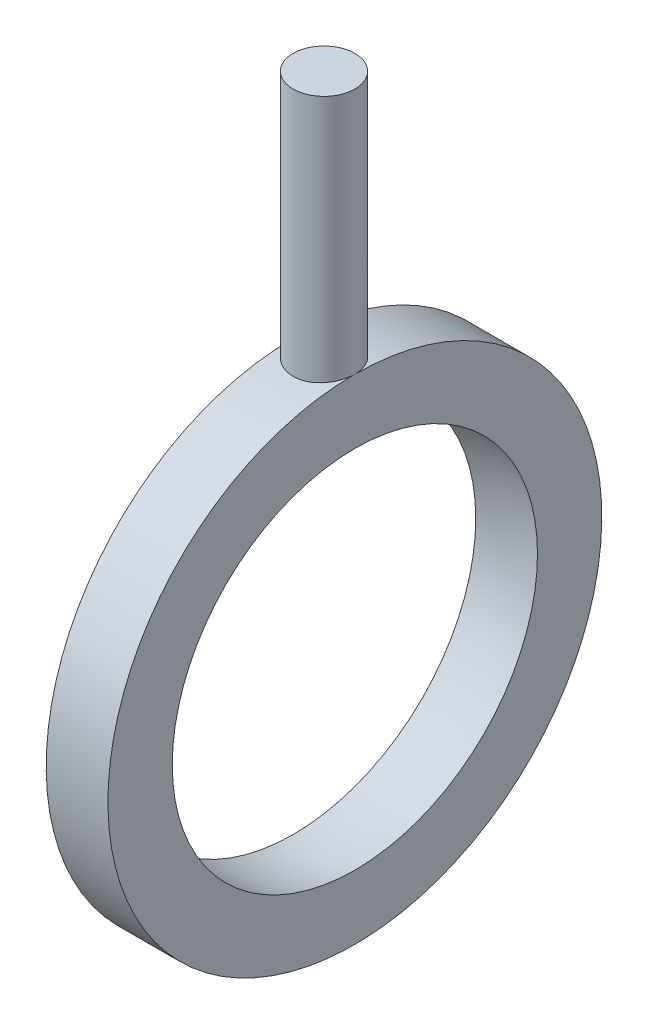
ISO-10303-21;
HEADER;
FILE_DESCRIPTION(('STEP AP214'),'2;1');
FILE_NAME('part.step','',(''),(''),'','','');
FILE_SCHEMA(('AUTOMOTIVE_DESIGN { 1 0 10303 214 1 1 1 1 }'));
ENDSEC;
DATA;
#1=APPLICATION_CONTEXT('core data for automotive mechanical design processes');
#2=APPLICATION_PROTOCOL_DEFINITION('international standard','automotive_design',2000,#1);
#3=PRODUCT_CONTEXT('',#1,'mechanical');
#4=PRODUCT('Part','Part','',(#3));
#5=PRODUCT_RELATED_PRODUCT_CATEGORY('part','',(#4));
#6=PRODUCT_DEFINITION_FORMATION('','',#4);
#7=PRODUCT_DEFINITION_CONTEXT('part definition',#1,'design');
#8=PRODUCT_DEFINITION('design','',#6,#7);
#9=PRODUCT_DEFINITION_SHAPE('','',#8);
#10=(LENGTH_UNIT() NAMED_UNIT(*) SI_UNIT(.MILLI.,.METRE.));
#11=(NAMED_UNIT(*) PLANE_ANGLE_UNIT() SI_UNIT($,.RADIAN.));
#12=(NAMED_UNIT(*) SI_UNIT($,.STERADIAN.) SOLID_ANGLE_UNIT());
#13=UNCERTAINTY_MEASURE_WITH_UNIT(LENGTH_MEASURE(1.E-05),#10,'distance_accuracy_value','');
#14=(GEOMETRIC_REPRESENTATION_CONTEXT(3) GLOBAL_UNCERTAINTY_ASSIGNED_CONTEXT((#13)) GLOBAL_UNIT_ASSIGNED_CONTEXT((#10,
#11,#12)) REPRESENTATION_CONTEXT('',''));
#15=CARTESIAN_POINT('',(0.,0.,0.));
#16=DIRECTION('',(0.,0.,1.));
#17=DIRECTION('',(1.,0.,0.));
#18=AXIS2_PLACEMENT_3D('',#15,#16,#17);
#19=CARTESIAN_POINT('',(2.5,20.,0.));
#20=DIRECTION('',(-1.,0.,0.));
#21=DIRECTION('',(0.,0.,1.));
#22=AXIS2_PLACEMENT_3D('',#19,#20,#21);
#23=PLANE('',#22);
#24=CARTESIAN_POINT('',(2.5,0.,0.));
#25=DIRECTION('',(-1.,0.,0.));
#26=DIRECTION('',(0.,0.,1.));
#27=AXIS2_PLACEMENT_3D('',#24,#25,#26);
#28=CIRCLE('',#27,20.);
#29=CARTESIAN_POINT('',(2.5,20.,0.));
#30=VERTEX_POINT('',#29);
#31=EDGE_CURVE('E57',#30,#30,#28,.T.);
#32=ORIENTED_EDGE('',*,*,#31,.F.);
#33=EDGE_LOOP('',(#32));
#34=FACE_BOUND('',#33,.T.);
#35=CARTESIAN_POINT('',(2.5,0.,0.));
#36=DIRECTION('',(-1.,0.,0.));
#37=DIRECTION('',(0.,0.,1.));
#38=AXIS2_PLACEMENT_3D('',#35,#36,#37);
#39=CIRCLE('',#38,14.790199457749);
#40=CARTESIAN_POINT('',(2.5,0.,14.790199457749));
#41=VERTEX_POINT('',#40);
#42=EDGE_CURVE('E46',#41,#41,#39,.T.);
#43=ORIENTED_EDGE('',*,*,#42,.T.);
#44=EDGE_LOOP('',(#43));
#45=FACE_BOUND('',#44,.T.);
#46=ADVANCED_FACE('F34',(#34,#45),#23,.F.);
#47=CARTESIAN_POINT('',(0.,0.,0.));
#48=DIRECTION('',(-1.,0.,0.));
#49=DIRECTION('',(0.,1.,0.));
#50=AXIS2_PLACEMENT_3D('',#47,#48,#49);
#51=SPHERICAL_SURFACE('',#50,15.);
#52=ORIENTED_EDGE('',*,*,#42,.F.);
#53=EDGE_LOOP('',(#52));
#54=FACE_BOUND('',#53,.T.);
#55=CARTESIAN_POINT('',(-2.5,0.,0.));
#56=DIRECTION('',(-1.,0.,0.));
#57=DIRECTION('',(0.,0.,1.));
#58=AXIS2_PLACEMENT_3D('',#55,#56,#57);
#59=CIRCLE('',#58,14.790199457749);
#60=CARTESIAN_POINT('',(-2.5,0.,14.790199457749));
#61=VERTEX_POINT('',#60);
#62=EDGE_CURVE('E66',#61,#61,#59,.T.);
#63=ORIENTED_EDGE('',*,*,#62,.T.);
#64=EDGE_LOOP('',(#63));
#65=FACE_BOUND('',#64,.T.);
#66=ADVANCED_FACE('F75',(#54,#65),#51,.F.);
#67=CARTESIAN_POINT('',(-2.5,20.,0.));
#68=DIRECTION('',(1.,0.,0.));
#69=DIRECTION('',(0.,0.,-1.));
#70=AXIS2_PLACEMENT_3D('',#67,#68,#69);
#71=PLANE('',#70);
#72=ORIENTED_EDGE('',*,*,#62,.F.);
#73=EDGE_LOOP('',(#72));
#74=FACE_BOUND('',#73,.T.);
#75=CARTESIAN_POINT('',(-2.5,0.,0.));
#76=DIRECTION('',(-1.,0.,0.));
#77=DIRECTION('',(0.,0.,1.));
#78=AXIS2_PLACEMENT_3D('',#75,#76,#77);
#79=CIRCLE('',#78,20.);
#80=CARTESIAN_POINT('',(-2.5,20.,0.));
#81=VERTEX_POINT('',#80);
#82=EDGE_CURVE('E62',#81,#81,#79,.T.);
#83=ORIENTED_EDGE('',*,*,#82,.T.);
#84=EDGE_LOOP('',(#83));
#85=FACE_BOUND('',#84,.T.);
#86=ADVANCED_FACE('F65',(#74,#85),#71,.F.);
#87=CARTESIAN_POINT('',(0.,0.,0.));
#88=DIRECTION('',(-1.,0.,0.));
#89=DIRECTION('',(0.,0.,1.));
#90=AXIS2_PLACEMENT_3D('',#87,#88,#89);
#91=CYLINDRICAL_SURFACE('',#90,20.);
#92=ORIENTED_EDGE('',*,*,#31,.T.);
#93=CARTESIAN_POINT('',(2.5,20.,0.));
#94=CARTESIAN_POINT('',(2.49999405906428,19.9999980489643,0.139841095555762));
#95=CARTESIAN_POINT('',(2.48822712083072,19.998517845549,0.279769574302748));
#96=CARTESIAN_POINT('',(2.44147224542921,19.9927554011136,0.555732802089754));
#97=CARTESIAN_POINT('',(2.40646006207661,19.9884702344143,0.691763330623746));
#98=CARTESIAN_POINT('',(2.31426235608592,19.9775806104441,0.955895574813055));
#99=CARTESIAN_POINT('',(2.25709175819015,19.9709777145554,1.08400256014614));
#100=CARTESIAN_POINT('',(2.12223271603021,19.956187008781,1.32877947489304));
#101=CARTESIAN_POINT('',(2.04454779146929,19.9479994708412,1.44545136155637));
#102=CARTESIAN_POINT('',(1.87040805016041,19.9309032130633,1.66471281693132));
#103=CARTESIAN_POINT('',(1.77386287065376,19.9219911469242,1.76723036493713));
#104=CARTESIAN_POINT('',(1.56493717646336,19.9044772600975,1.9546527935575));
#105=CARTESIAN_POINT('',(1.45255585508675,19.8958754552427,2.03955677639225));
#106=CARTESIAN_POINT('',(1.21468002243433,19.8799230561958,2.18961016128394));
#107=CARTESIAN_POINT('',(1.08914263843206,19.8725767717791,2.25469209594107));
#108=CARTESIAN_POINT('',(0.828812948052639,19.8600112845768,2.36282307657512));
#109=CARTESIAN_POINT('',(0.694020992852986,19.8547920011314,2.40587295806522));
#110=CARTESIAN_POINT('',(0.419755804413233,19.8471033960361,2.46849898002477));
#111=CARTESIAN_POINT('',(0.280310742295805,19.8446198343674,2.4881967147317));
#112=CARTESIAN_POINT('',(7.37365281651013E-05,19.8426402814279,2.50393554955723));
#113=CARTESIAN_POINT('',(-0.140718152731293,19.8431441700151,2.49997760100242));
#114=CARTESIAN_POINT('',(-0.418804827248784,19.8470695536975,2.46861723644791));
#115=CARTESIAN_POINT('',(-0.556114986200265,19.8504743796033,2.4413487629847));
#116=CARTESIAN_POINT('',(-0.824195021218988,19.8597919975763,2.36435038318205));
#117=CARTESIAN_POINT('',(-0.954964764714041,19.8657048404572,2.3146200217519));
#118=CARTESIAN_POINT('',(-1.20666799902169,19.8793911586465,2.19396555991165));
#119=CARTESIAN_POINT('',(-1.32757330024899,19.8871697321144,2.12298325370764));
#120=CARTESIAN_POINT('',(-1.55580669441325,19.903707114306,1.96188146945692));
#121=CARTESIAN_POINT('',(-1.66313416597368,19.9124659678566,1.87176111608078));
#122=CARTESIAN_POINT('',(-1.86194271072274,19.9300510989042,1.67419911075378));
#123=CARTESIAN_POINT('',(-1.95330909176598,19.9388774238689,1.56664200784001));
#124=CARTESIAN_POINT('',(-2.11670888003055,19.9555463255585,1.33765716911392));
#125=CARTESIAN_POINT('',(-2.188742242672,19.9633889000151,1.21622940131825));
#126=CARTESIAN_POINT('',(-2.31143132046392,19.9772115221858,0.962861671363481));
#127=CARTESIAN_POINT('',(-2.36207985388123,19.9831909440154,0.830918195337716));
#128=CARTESIAN_POINT('',(-2.44047049352326,19.9926078578006,0.560307940431056));
#129=CARTESIAN_POINT('',(-2.46821367213705,19.9960454687587,0.421641476630666));
#130=CARTESIAN_POINT('',(-2.49985742426056,19.9999759641076,0.142513163913496));
#131=CARTESIAN_POINT('',(-2.50391599236407,20.0004883614264,0.00206949019860585));
#132=CARTESIAN_POINT('',(-2.48849226594405,19.9985633800543,-0.277496036497498));
#133=CARTESIAN_POINT('',(-2.46901047274841,19.9961260641821,-0.416617917564708));
#134=CARTESIAN_POINT('',(-2.40719029122562,19.9885876875669,-0.689124507721523));
#135=CARTESIAN_POINT('',(-2.36492723659737,19.9834954081387,-0.822526570424706));
#136=CARTESIAN_POINT('',(-2.25882254808708,19.971217231002,-1.08034965485841));
#137=CARTESIAN_POINT('',(-2.19498018150857,19.9640312622062,-1.20477037146532));
#138=CARTESIAN_POINT('',(-2.04714686249254,19.9483182291011,-1.44180452068743));
#139=CARTESIAN_POINT('',(-1.96305371019437,19.9397844404251,-1.55435375994382));
#140=CARTESIAN_POINT('',(-1.7772505024658,19.9223514232566,-1.76379698962632));
#141=CARTESIAN_POINT('',(-1.67553974774901,19.913452180269,-1.86069035833686));
#142=CARTESIAN_POINT('',(-1.45669258324286,19.8962310546258,-2.03663195881802));
#143=CARTESIAN_POINT('',(-1.33947165368961,19.8879127472133,-2.11557546056794));
#144=CARTESIAN_POINT('',(-1.09334175514529,19.8728541103715,-2.25265288944351));
#145=CARTESIAN_POINT('',(-0.964433020523481,19.8661137493103,-2.31078723372837));
#146=CARTESIAN_POINT('',(-0.698924680852386,19.85499850393,-2.40442657886654));
#147=CARTESIAN_POINT('',(-0.562346169952028,19.8506174518479,-2.43999062745711));
#148=CARTESIAN_POINT('',(-0.285097516219333,19.8446991590745,-2.48766999386785));
#149=CARTESIAN_POINT('',(-0.144427564040997,19.8431617860878,-2.49978640253576));
#150=CARTESIAN_POINT('',(0.13596892920468,19.8431087698246,-2.50020653608484));
#151=CARTESIAN_POINT('',(0.27569524833189,19.8445722475195,-2.48867479769928));
#152=CARTESIAN_POINT('',(0.55120712934508,19.850311145372,-2.44247440484933));
#153=CARTESIAN_POINT('',(0.686992690808798,19.8545865658308,-2.40780574790577));
#154=CARTESIAN_POINT('',(0.950746956766402,19.8654611577455,-2.31636707368966));
#155=CARTESIAN_POINT('',(1.07871844502182,19.8720594959278,-2.25960498097093));
#156=CARTESIAN_POINT('',(1.32334665404832,19.8868378324482,-2.12560690215031));
#157=CARTESIAN_POINT('',(1.44000323301983,19.8950178506041,-2.04837065950959));
#158=CARTESIAN_POINT('',(1.65953122534048,19.9121060475223,-1.87500633126584));
#159=CARTESIAN_POINT('',(1.76230546095498,19.9210187208403,-1.77875562577496));
#160=CARTESIAN_POINT('',(1.95030682516798,19.938528315929,-1.57035022696838));
#161=CARTESIAN_POINT('',(2.03552981077431,19.9471251627559,-1.45819178914157));
#162=CARTESIAN_POINT('',(2.1862853571053,19.9630705658675,-1.22066562085421));
#163=CARTESIAN_POINT('',(2.25174180589926,19.970414250783,-1.09524927959617));
#164=CARTESIAN_POINT('',(2.36057124291628,19.9829764907672,-0.83518290230128));
#165=CARTESIAN_POINT('',(2.40396822635346,19.9881973536958,-0.700543080870235));
#166=CARTESIAN_POINT('',(2.45705933817131,19.9946672032775,-0.471005771967924));
#167=CARTESIAN_POINT('',(2.47313894198207,19.9966572589545,-0.37755566351692));
#168=CARTESIAN_POINT('',(2.49461124569322,19.9993243132919,-0.189417063212434));
#169=CARTESIAN_POINT('',(2.5000040243993,20.0000013216347,-0.0947285804960271));
#170=CARTESIAN_POINT('',(2.5,20.,0.));
#171=B_SPLINE_CURVE_WITH_KNOTS('',3,(#93,#94,#95,#96,#97,#98,#99,#100,#101,#102,#103,#104,#105,
#106,#107,#108,#109,#110,#111,#112,#113,#114,#115,#116,#117,#118,#119,#120,#121,#122,#123,#124,
#125,#126,#127,#128,#129,#130,#131,#132,#133,#134,#135,#136,#137,#138,#139,#140,#141,#142,#143,
#144,#145,#146,#147,#148,#149,#150,#151,#152,#153,#154,#155,#156,#157,#158,#159,#160,#161,#162,
#163,#164,#165,#166,#167,#168,#169,#170),.UNSPECIFIED.,.T.,.F.,(4,2,2,2,2,2,2,2,2,2,2,2,2,2,2,2,
2,2,2,2,2,2,2,2,2,2,2,2,2,2,2,2,2,2,2,2,2,2,4),(0.,0.419177272776248,0.838792460943428,
1.25812550818177,1.67738665591073,2.09870813201843,2.52005107800011,2.9428125031887,
3.36555789496807,3.78609225286321,4.20660969884664,4.62472696441692,5.04285270166242,
5.46213426285534,5.88143500513639,6.30363478136417,6.72583553113114,7.14817795731606,
7.57050060903781,7.99000279391922,8.40949604501929,8.82761053893396,9.24573923078948,
9.66602402928423,10.0863255137509,10.5090197150757,10.9317054422154,11.3532807428093,
11.7748364301062,12.1934690120222,12.6121016387955,13.0305842470649,13.4490720991227,
13.8703523769183,14.2917319847001,14.7147140303685,15.1372349868403,15.4211884318763,
15.7051397830044),.UNSPECIFIED.);
#172=EDGE_CURVE('E11',#30,#81,#171,.T.);
#173=ORIENTED_EDGE('',*,*,#172,.T.);
#174=ORIENTED_EDGE('',*,*,#82,.F.);
#175=CARTESIAN_POINT('',(0.,19.8431348329844,2.5));
#176=CARTESIAN_POINT('',(0.139836283800461,19.8431368414674,2.49999405483338));
#177=CARTESIAN_POINT('',(0.279759964930601,19.8446289499888,2.4882278990166));
#178=CARTESIAN_POINT('',(0.555713225428463,19.8504339085542,2.44147641371667));
#179=CARTESIAN_POINT('',(0.691738580501781,19.8547497060959,2.40646682109081));
#180=CARTESIAN_POINT('',(0.955859882107615,19.8657057380876,2.31427669282774));
#181=CARTESIAN_POINT('',(1.08396114211641,19.8723443946258,2.25711120479872));
#182=CARTESIAN_POINT('',(1.32872845182534,19.8871962351098,2.12226419842905));
#183=CARTESIAN_POINT('',(1.44539645174366,19.8954091498188,2.04458618737466));
#184=CARTESIAN_POINT('',(1.66466224712152,19.9125355924631,1.87045345026455));
#185=CARTESIAN_POINT('',(1.76718680231872,19.9214524170269,1.77390681502433));
#186=CARTESIAN_POINT('',(1.95462276893924,19.9389523287519,1.5649752606712));
#187=CARTESIAN_POINT('',(2.03953330409474,19.9475353992921,1.45258955405802));
#188=CARTESIAN_POINT('',(2.18959357950632,19.96343444613,1.21470983067598));
#189=CARTESIAN_POINT('',(2.25467704509965,19.9707461384685,1.08917369556112));
#190=CARTESIAN_POINT('',(2.36281119994098,19.9832423695448,0.828846718055914));
#191=CARTESIAN_POINT('',(2.40586270692652,19.9884269872296,0.694056219360904));
#192=CARTESIAN_POINT('',(2.46849206833443,19.9960616870624,0.419795687751113));
#193=CARTESIAN_POINT('',(2.48819167852389,19.9985259483594,0.280353859663377));
#194=CARTESIAN_POINT('',(2.50393538503654,20.0004906972921,0.000123200686545519));
#195=CARTESIAN_POINT('',(2.49998041195254,19.9999913015208,-0.140665576994772));
#196=CARTESIAN_POINT('',(2.46862479724258,19.9960964777001,-0.418765268974549));
#197=CARTESIAN_POINT('',(2.44135510151863,19.9927172245573,-0.556091205764454));
#198=CARTESIAN_POINT('',(2.36434882337007,19.9834605594233,-0.824202163905377));
#199=CARTESIAN_POINT('',(2.31461181383317,19.9775830999405,-0.954987060856207));
#200=CARTESIAN_POINT('',(2.19394350721622,19.9639625780791,-1.20670881543864));
#201=CARTESIAN_POINT('',(2.12295554226982,19.9562145384324,-1.32761822784052));
#202=CARTESIAN_POINT('',(1.96184163778397,19.9397196906528,-1.55585745230648));
#203=CARTESIAN_POINT('',(1.87171482053143,19.9309728367226,-1.66318664121736));
#204=CARTESIAN_POINT('',(1.67414818140162,19.9133886752351,-1.86198803077295));
#205=CARTESIAN_POINT('',(1.56659424045334,19.9045511580473,-1.953346839996));
#206=CARTESIAN_POINT('',(1.33761844321755,19.8878407194058,-2.11673285062511));
#207=CARTESIAN_POINT('',(1.21619654346194,19.8799678009758,-2.1887599914351));
#208=CARTESIAN_POINT('',(0.962830504437674,19.8660780261272,-2.31144457358274));
#209=CARTESIAN_POINT('',(0.8308819200468,19.8600619590813,-2.36209292986233));
#210=CARTESIAN_POINT('',(0.560260546473169,19.8505824249596,-2.44048165446809));
#211=CARTESIAN_POINT('',(0.421588081691279,19.847118834867,-2.46822312679962));
#212=CARTESIAN_POINT('',(0.142456818000235,19.8431588878405,-2.49986043190861));
#213=CARTESIAN_POINT('',(0.00201637691120621,19.8426426744238,-2.50391584199829));
#214=CARTESIAN_POINT('',(-0.277541929665414,19.8445834111965,-2.48848695323056));
#215=CARTESIAN_POINT('',(-0.416659823279317,19.8470402980145,-2.46900315610981));
#216=CARTESIAN_POINT('',(-0.689145763577865,19.8546322848399,-2.40718328579773));
#217=CARTESIAN_POINT('',(-0.822531615190406,19.8597583269466,-2.36492448374606));
#218=CARTESIAN_POINT('',(-1.08032415485316,19.8721036997081,-2.25883371911613));
#219=CARTESIAN_POINT('',(-1.20473052724087,19.8793231039076,-2.19500099858123));
#220=CARTESIAN_POINT('',(-1.44175464381299,19.8950893135323,-2.04718202215492));
#221=CARTESIAN_POINT('',(-1.55430666531442,19.9036429273708,-1.96309111957711));
#222=CARTESIAN_POINT('',(-1.76375655393503,19.9210923955102,-1.77729074236896));
#223=CARTESIAN_POINT('',(-1.86065381186799,19.9299882631129,-1.67558058242549));
#224=CARTESIAN_POINT('',(-2.03660418733441,19.9471808868696,-1.45673177555852));
#225=CARTESIAN_POINT('',(-2.115552446795,19.9554739391252,-1.33950849211704));
#226=CARTESIAN_POINT('',(-2.2526382176338,19.9704711303161,-1.09337258168179));
#227=CARTESIAN_POINT('',(-2.31077614848097,19.9771753012772,-0.964460190368323));
#228=CARTESIAN_POINT('',(-2.40441778690803,19.9882229065319,-0.698953859139455));
#229=CARTESIAN_POINT('',(-2.43998209603162,19.992572656877,-0.56238156651178));
#230=CARTESIAN_POINT('',(-2.48766408922676,19.9984475467757,-0.28514605727796));
#231=CARTESIAN_POINT('',(-2.49978283059923,19.9999728137019,-0.144483025438105));
#232=CARTESIAN_POINT('',(-2.50020992229216,20.0000262801365,0.135917183343782));
#233=CARTESIAN_POINT('',(-2.48867996056799,19.998574831678,0.275654137714727));
#234=CARTESIAN_POINT('',(-2.44247938656915,19.9928784115798,0.551187741452621));
#235=CARTESIAN_POINT('',(-2.40780879038818,19.9886334418829,0.686984393559879));
#236=CARTESIAN_POINT('',(-2.31636188565037,19.9778248521189,0.950761442987287));
#237=CARTESIAN_POINT('',(-2.25959332062701,19.9712620443393,1.07874456015946));
#238=CARTESIAN_POINT('',(-2.12557868539222,19.9565444760682,1.32339333714413));
#239=CARTESIAN_POINT('',(-2.04833237173744,19.9483896966512,1.44005886238844));
#240=CARTESIAN_POINT('',(-1.8749567846645,19.9313319392356,1.65958676796215));
#241=CARTESIAN_POINT('',(-1.77870720647963,19.9224244127137,1.76235378783277));
#242=CARTESIAN_POINT('',(-1.57030705596786,19.9049015902109,1.95034111882088));
#243=CARTESIAN_POINT('',(-1.45815272249685,19.8962863639518,2.03555726779921));
#244=CARTESIAN_POINT('',(-1.220630077313,19.8802881136638,2.18630524251152));
#245=CARTESIAN_POINT('',(-1.09521241010682,19.8729099764648,2.25175978314741));
#246=CARTESIAN_POINT('',(-0.835143259447477,19.8602785801803,2.36058528832415));
#247=CARTESIAN_POINT('',(-0.700502000707672,19.8550230113382,2.40398027122394));
#248=CARTESIAN_POINT('',(-0.470970012950819,19.8485078683333,2.45706589624051));
#249=CARTESIAN_POINT('',(-0.377527048460255,19.8465030152112,2.47314303101112));
#250=CARTESIAN_POINT('',(-0.189402750035245,19.8438158223071,2.49461205590498));
#251=CARTESIAN_POINT('',(-0.0947214255020873,19.8431334724909,2.50000402709971));
#252=CARTESIAN_POINT('',(0.,19.8431348329844,2.5));
#253=B_SPLINE_CURVE_WITH_KNOTS('',3,(#175,#176,#177,#178,#179,#180,#181,#182,#183,#184,#185,
#186,#187,#188,#189,#190,#191,#192,#193,#194,#195,#196,#197,#198,#199,#200,#201,#202,#203,#204,
#205,#206,#207,#208,#209,#210,#211,#212,#213,#214,#215,#216,#217,#218,#219,#220,#221,#222,#223,
#224,#225,#226,#227,#228,#229,#230,#231,#232,#233,#234,#235,#236,#237,#238,#239,#240,#241,#242,
#243,#244,#245,#246,#247,#248,#249,#250,#251,#252),.UNSPECIFIED.,.T.,.F.,(4,2,2,2,2,2,2,2,2,2,2,
2,2,2,2,2,2,2,2,2,2,2,2,2,2,2,2,2,2,2,2,2,2,2,2,2,2,2,4),(0.,0.419162817491661,
0.838763876176506,1.25808045260533,1.67732537953025,2.09866577551479,2.52002712744992,
2.94278186148154,3.36552090342243,3.7860459694387,4.20655449172521,4.62471664935451,
5.04288675674202,5.46218204415217,5.88149656471518,6.30367697380183,6.72585870621838,
7.14821966741422,7.57056027158602,7.99005217808296,8.40953514329529,8.82760376295146,
9.24568707214267,9.66597819546525,10.0862856699722,10.5089888589476,10.9316835271129,
11.3532385678735,11.7747745977523,12.1934381629067,12.612101436892,13.030618135465,
13.4491398096666,13.8704012889325,14.2917625544224,14.7147509770793,15.1372778598593,
15.4212098963687,15.7051397785939),.UNSPECIFIED.);
#254=EDGE_CURVE('E52',#30,#81,#253,.T.);
#255=ORIENTED_EDGE('',*,*,#254,.F.);
#256=EDGE_LOOP('',(#92,#173,#174,#255));
#257=FACE_BOUND('',#256,.T.);
#258=ADVANCED_FACE('F61',(#257),#91,.T.);
#259=CARTESIAN_POINT('',(0.,40.,0.));
#260=DIRECTION('',(0.,1.,0.));
#261=DIRECTION('',(0.,0.,1.));
#262=AXIS2_PLACEMENT_3D('',#259,#260,#261);
#263=PLANE('',#262);
#264=CARTESIAN_POINT('',(0.,40.,0.));
#265=DIRECTION('',(0.,1.,0.));
#266=DIRECTION('',(0.,0.,1.));
#267=AXIS2_PLACEMENT_3D('',#264,#265,#266);
#268=CIRCLE('',#267,2.5);
#269=CARTESIAN_POINT('',(0.,40.,2.5));
#270=VERTEX_POINT('',#269);
#271=EDGE_CURVE('E58',#270,#270,#268,.T.);
#272=ORIENTED_EDGE('',*,*,#271,.T.);
#273=EDGE_LOOP('',(#272));
#274=FACE_BOUND('',#273,.T.);
#275=ADVANCED_FACE('F85',(#274),#263,.T.);
#276=CARTESIAN_POINT('',(0.,-20.001,0.));
#277=DIRECTION('',(0.,1.,0.));
#278=DIRECTION('',(0.,0.,1.));
#279=AXIS2_PLACEMENT_3D('',#276,#277,#278);
#280=CYLINDRICAL_SURFACE('',#279,2.5);
#281=ORIENTED_EDGE('',*,*,#271,.F.);
#282=EDGE_LOOP('',(#281));
#283=FACE_BOUND('',#282,.T.);
#284=ORIENTED_EDGE('',*,*,#254,.T.);
#285=ORIENTED_EDGE('',*,*,#172,.F.);
#286=EDGE_LOOP('',(#284,#285));
#287=FACE_BOUND('',#286,.T.);
#288=ADVANCED_FACE('F53',(#283,#287),#280,.T.);
#289=CLOSED_SHELL('',(#46,#66,#86,#258,#275,#288));
#290=MANIFOLD_SOLID_BREP('B2',#289);
#291=ADVANCED_BREP_SHAPE_REPRESENTATION('',(#18,#290),#14);
#292=SHAPE_DEFINITION_REPRESENTATION(#9,#291);
ENDSEC;
END-ISO-10303-21;
